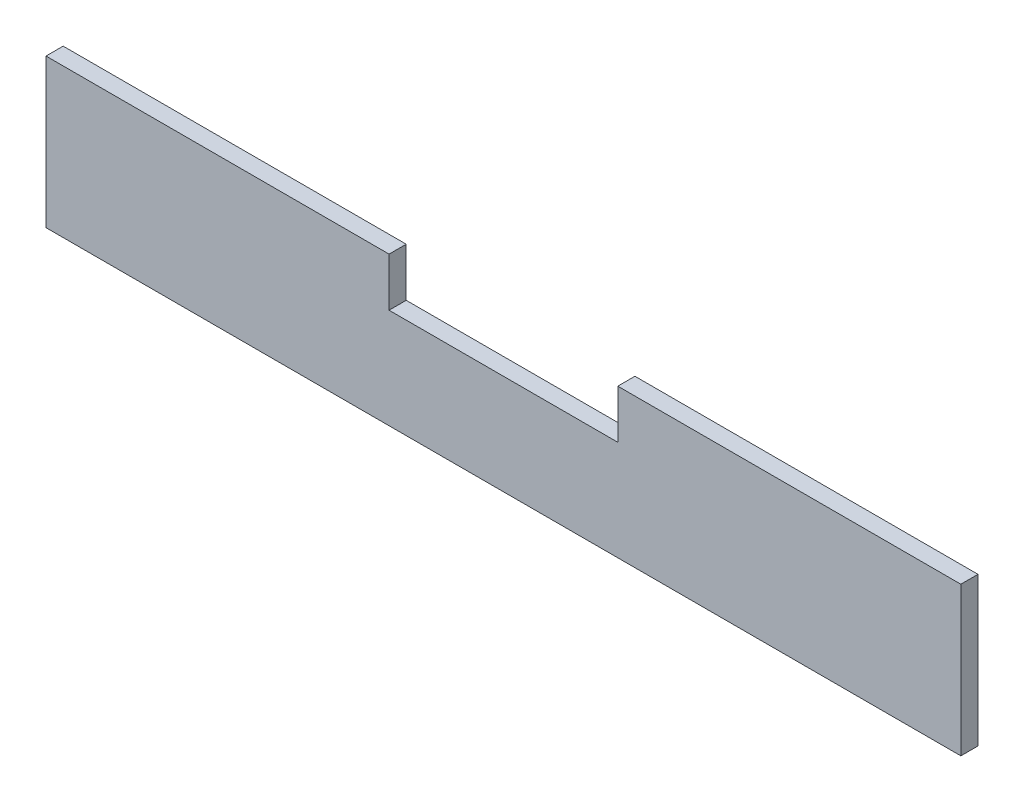
ISO-10303-21;
HEADER;
FILE_DESCRIPTION(('STEP AP214'),'2;1');
FILE_NAME('part.step','',(''),(''),'','','');
FILE_SCHEMA(('AUTOMOTIVE_DESIGN { 1 0 10303 214 1 1 1 1 }'));
ENDSEC;
DATA;
#1=APPLICATION_CONTEXT('core data for automotive mechanical design processes');
#2=APPLICATION_PROTOCOL_DEFINITION('international standard','automotive_design',2000,#1);
#3=PRODUCT_CONTEXT('',#1,'mechanical');
#4=PRODUCT('Part','Part','',(#3));
#5=PRODUCT_RELATED_PRODUCT_CATEGORY('part','',(#4));
#6=PRODUCT_DEFINITION_FORMATION('','',#4);
#7=PRODUCT_DEFINITION_CONTEXT('part definition',#1,'design');
#8=PRODUCT_DEFINITION('design','',#6,#7);
#9=PRODUCT_DEFINITION_SHAPE('','',#8);
#10=(LENGTH_UNIT() NAMED_UNIT(*) SI_UNIT(.MILLI.,.METRE.));
#11=(NAMED_UNIT(*) PLANE_ANGLE_UNIT() SI_UNIT($,.RADIAN.));
#12=(NAMED_UNIT(*) SI_UNIT($,.STERADIAN.) SOLID_ANGLE_UNIT());
#13=UNCERTAINTY_MEASURE_WITH_UNIT(LENGTH_MEASURE(1.E-05),#10,'distance_accuracy_value','');
#14=(GEOMETRIC_REPRESENTATION_CONTEXT(3) GLOBAL_UNCERTAINTY_ASSIGNED_CONTEXT((#13)) GLOBAL_UNIT_ASSIGNED_CONTEXT((#10,
#11,#12)) REPRESENTATION_CONTEXT('',''));
#15=CARTESIAN_POINT('',(0.,0.,0.));
#16=DIRECTION('',(0.,0.,1.));
#17=DIRECTION('',(1.,0.,0.));
#18=AXIS2_PLACEMENT_3D('',#15,#16,#17);
#19=CARTESIAN_POINT('',(0.,76.2,0.));
#20=DIRECTION('',(0.,1.,0.));
#21=DIRECTION('',(0.,0.,1.));
#22=AXIS2_PLACEMENT_3D('',#19,#20,#21);
#23=PLANE('',#22);
#24=DIRECTION('',(0.,0.,-1.));
#25=VECTOR('',#24,1.);
#26=CARTESIAN_POINT('',(127.,76.2,0.));
#27=LINE('',#26,#25);
#28=CARTESIAN_POINT('',(127.,76.2,-1016.));
#29=VERTEX_POINT('',#28);
#30=CARTESIAN_POINT('',(127.,76.2,-1035.05));
#31=VERTEX_POINT('',#30);
#32=EDGE_CURVE('E11',#29,#31,#27,.T.);
#33=ORIENTED_EDGE('',*,*,#32,.F.);
#34=DIRECTION('',(1.,0.,0.));
#35=VECTOR('',#34,1.);
#36=CARTESIAN_POINT('',(0.,76.2,-1016.));
#37=LINE('',#36,#35);
#38=CARTESIAN_POINT('',(508.,76.2,-1016.));
#39=VERTEX_POINT('',#38);
#40=EDGE_CURVE('E168',#29,#39,#37,.T.);
#41=ORIENTED_EDGE('',*,*,#40,.T.);
#42=DIRECTION('',(0.,0.,-1.));
#43=VECTOR('',#42,1.);
#44=CARTESIAN_POINT('',(508.,76.2,0.));
#45=LINE('',#44,#43);
#46=CARTESIAN_POINT('',(508.,76.2,-1035.05));
#47=VERTEX_POINT('',#46);
#48=EDGE_CURVE('E128',#39,#47,#45,.T.);
#49=ORIENTED_EDGE('',*,*,#48,.T.);
#50=DIRECTION('',(1.,0.,0.));
#51=VECTOR('',#50,1.);
#52=CARTESIAN_POINT('',(0.,76.2,-1035.05));
#53=LINE('',#52,#51);
#54=EDGE_CURVE('E117',#31,#47,#53,.T.);
#55=ORIENTED_EDGE('',*,*,#54,.F.);
#56=EDGE_LOOP('',(#33,#41,#49,#55));
#57=FACE_BOUND('',#56,.T.);
#58=ADVANCED_FACE('F42',(#57),#23,.T.);
#59=CARTESIAN_POINT('',(-508.,-88.9,0.));
#60=DIRECTION('',(1.,0.,0.));
#61=DIRECTION('',(0.,0.,-1.));
#62=AXIS2_PLACEMENT_3D('',#59,#60,#61);
#63=PLANE('',#62);
#64=DIRECTION('',(0.,1.,0.));
#65=VECTOR('',#64,1.);
#66=CARTESIAN_POINT('',(-508.,-88.9,-1016.));
#67=LINE('',#66,#65);
#68=CARTESIAN_POINT('',(-508.,-88.9,-1016.));
#69=VERTEX_POINT('',#68);
#70=CARTESIAN_POINT('',(-508.,76.2,-1016.));
#71=VERTEX_POINT('',#70);
#72=EDGE_CURVE('E51',#69,#71,#67,.T.);
#73=ORIENTED_EDGE('',*,*,#72,.T.);
#74=DIRECTION('',(0.,0.,-1.));
#75=VECTOR('',#74,1.);
#76=CARTESIAN_POINT('',(-508.,76.2,0.));
#77=LINE('',#76,#75);
#78=CARTESIAN_POINT('',(-508.,76.2,-1035.05));
#79=VERTEX_POINT('',#78);
#80=EDGE_CURVE('E135',#71,#79,#77,.T.);
#81=ORIENTED_EDGE('',*,*,#80,.T.);
#82=DIRECTION('',(0.,1.,0.));
#83=VECTOR('',#82,1.);
#84=CARTESIAN_POINT('',(-508.,-88.9,-1035.05));
#85=LINE('',#84,#83);
#86=CARTESIAN_POINT('',(-508.,-88.9,-1035.05));
#87=VERTEX_POINT('',#86);
#88=EDGE_CURVE('E159',#87,#79,#85,.T.);
#89=ORIENTED_EDGE('',*,*,#88,.F.);
#90=DIRECTION('',(0.,0.,-1.));
#91=VECTOR('',#90,1.);
#92=CARTESIAN_POINT('',(-508.,-88.9,0.));
#93=LINE('',#92,#91);
#94=EDGE_CURVE('E153',#69,#87,#93,.T.);
#95=ORIENTED_EDGE('',*,*,#94,.F.);
#96=EDGE_LOOP('',(#73,#81,#89,#95));
#97=FACE_BOUND('',#96,.T.);
#98=ADVANCED_FACE('F179',(#97),#63,.F.);
#99=CARTESIAN_POINT('',(0.,-88.9,0.));
#100=DIRECTION('',(0.,1.,0.));
#101=DIRECTION('',(0.,0.,1.));
#102=AXIS2_PLACEMENT_3D('',#99,#100,#101);
#103=PLANE('',#102);
#104=DIRECTION('',(1.,0.,0.));
#105=VECTOR('',#104,1.);
#106=CARTESIAN_POINT('',(0.,-88.9,-1016.));
#107=LINE('',#106,#105);
#108=CARTESIAN_POINT('',(508.,-88.9,-1016.));
#109=VERTEX_POINT('',#108);
#110=EDGE_CURVE('E143',#69,#109,#107,.T.);
#111=ORIENTED_EDGE('',*,*,#110,.F.);
#112=ORIENTED_EDGE('',*,*,#94,.T.);
#113=DIRECTION('',(1.,0.,0.));
#114=VECTOR('',#113,1.);
#115=CARTESIAN_POINT('',(0.,-88.9,-1035.05));
#116=LINE('',#115,#114);
#117=CARTESIAN_POINT('',(508.,-88.9,-1035.05));
#118=VERTEX_POINT('',#117);
#119=EDGE_CURVE('E150',#87,#118,#116,.T.);
#120=ORIENTED_EDGE('',*,*,#119,.T.);
#121=DIRECTION('',(0.,0.,-1.));
#122=VECTOR('',#121,1.);
#123=CARTESIAN_POINT('',(508.,-88.9,0.));
#124=LINE('',#123,#122);
#125=EDGE_CURVE('E146',#109,#118,#124,.T.);
#126=ORIENTED_EDGE('',*,*,#125,.F.);
#127=EDGE_LOOP('',(#111,#112,#120,#126));
#128=FACE_BOUND('',#127,.T.);
#129=ADVANCED_FACE('F177',(#128),#103,.F.);
#130=CARTESIAN_POINT('',(508.,-88.9,0.));
#131=DIRECTION('',(1.,0.,0.));
#132=DIRECTION('',(0.,0.,-1.));
#133=AXIS2_PLACEMENT_3D('',#130,#131,#132);
#134=PLANE('',#133);
#135=DIRECTION('',(0.,1.,0.));
#136=VECTOR('',#135,1.);
#137=CARTESIAN_POINT('',(508.,-88.9,-1035.05));
#138=LINE('',#137,#136);
#139=EDGE_CURVE('E162',#118,#47,#138,.T.);
#140=ORIENTED_EDGE('',*,*,#139,.T.);
#141=ORIENTED_EDGE('',*,*,#48,.F.);
#142=DIRECTION('',(0.,1.,0.));
#143=VECTOR('',#142,1.);
#144=CARTESIAN_POINT('',(508.,-88.9,-1016.));
#145=LINE('',#144,#143);
#146=EDGE_CURVE('E156',#109,#39,#145,.T.);
#147=ORIENTED_EDGE('',*,*,#146,.F.);
#148=ORIENTED_EDGE('',*,*,#125,.T.);
#149=EDGE_LOOP('',(#140,#141,#147,#148));
#150=FACE_BOUND('',#149,.T.);
#151=ADVANCED_FACE('F172',(#150),#134,.T.);
#152=CARTESIAN_POINT('',(0.,22.225,0.));
#153=DIRECTION('',(0.,1.,0.));
#154=DIRECTION('',(0.,0.,1.));
#155=AXIS2_PLACEMENT_3D('',#152,#153,#154);
#156=PLANE('',#155);
#157=DIRECTION('',(0.,0.,1.));
#158=VECTOR('',#157,1.);
#159=CARTESIAN_POINT('',(127.,22.2250000000002,-1035.05));
#160=LINE('',#159,#158);
#161=CARTESIAN_POINT('',(127.,22.2250000000002,-1035.05));
#162=VERTEX_POINT('',#161);
#163=CARTESIAN_POINT('',(127.,22.2250000000002,-1016.));
#164=VERTEX_POINT('',#163);
#165=EDGE_CURVE('E187',#162,#164,#160,.T.);
#166=ORIENTED_EDGE('',*,*,#165,.F.);
#167=DIRECTION('',(1.,0.,0.));
#168=VECTOR('',#167,1.);
#169=CARTESIAN_POINT('',(-127.,22.2250000000002,-1035.05));
#170=LINE('',#169,#168);
#171=CARTESIAN_POINT('',(-127.,22.2250000000002,-1035.05));
#172=VERTEX_POINT('',#171);
#173=EDGE_CURVE('E121',#172,#162,#170,.T.);
#174=ORIENTED_EDGE('',*,*,#173,.F.);
#175=DIRECTION('',(0.,0.,-1.));
#176=VECTOR('',#175,1.);
#177=CARTESIAN_POINT('',(-127.,22.2250000000002,-1035.05));
#178=LINE('',#177,#176);
#179=CARTESIAN_POINT('',(-127.,22.2250000000002,-1016.));
#180=VERTEX_POINT('',#179);
#181=EDGE_CURVE('E198',#180,#172,#178,.T.);
#182=ORIENTED_EDGE('',*,*,#181,.F.);
#183=DIRECTION('',(-1.,0.,0.));
#184=VECTOR('',#183,1.);
#185=CARTESIAN_POINT('',(0.,22.225,-1016.));
#186=LINE('',#185,#184);
#187=EDGE_CURVE('E201',#164,#180,#186,.T.);
#188=ORIENTED_EDGE('',*,*,#187,.F.);
#189=EDGE_LOOP('',(#166,#174,#182,#188));
#190=FACE_BOUND('',#189,.T.);
#191=ADVANCED_FACE('F220',(#190),#156,.T.);
#192=CARTESIAN_POINT('',(0.,-88.9,-1035.05));
#193=DIRECTION('',(0.,0.,1.));
#194=DIRECTION('',(1.,0.,0.));
#195=AXIS2_PLACEMENT_3D('',#192,#193,#194);
#196=PLANE('',#195);
#197=CARTESIAN_POINT('',(-127.,76.2,-1035.05));
#198=VERTEX_POINT('',#197);
#199=EDGE_CURVE('E130',#79,#198,#53,.T.);
#200=ORIENTED_EDGE('',*,*,#199,.T.);
#201=DIRECTION('',(0.,1.,0.));
#202=VECTOR('',#201,1.);
#203=CARTESIAN_POINT('',(-127.,-2063.39960907998,-1035.05));
#204=LINE('',#203,#202);
#205=EDGE_CURVE('E123',#172,#198,#204,.T.);
#206=ORIENTED_EDGE('',*,*,#205,.F.);
#207=ORIENTED_EDGE('',*,*,#173,.T.);
#208=DIRECTION('',(0.,1.,0.));
#209=VECTOR('',#208,1.);
#210=CARTESIAN_POINT('',(127.,-2063.39960907998,-1035.05));
#211=LINE('',#210,#209);
#212=EDGE_CURVE('E108',#162,#31,#211,.T.);
#213=ORIENTED_EDGE('',*,*,#212,.T.);
#214=ORIENTED_EDGE('',*,*,#54,.T.);
#215=ORIENTED_EDGE('',*,*,#139,.F.);
#216=ORIENTED_EDGE('',*,*,#119,.F.);
#217=ORIENTED_EDGE('',*,*,#88,.T.);
#218=EDGE_LOOP('',(#200,#206,#207,#213,#214,#215,#216,#217));
#219=FACE_BOUND('',#218,.T.);
#220=ADVANCED_FACE('F115',(#219),#196,.F.);
#221=CARTESIAN_POINT('',(0.,-88.9,-1016.));
#222=DIRECTION('',(0.,0.,1.));
#223=DIRECTION('',(1.,0.,0.));
#224=AXIS2_PLACEMENT_3D('',#221,#222,#223);
#225=PLANE('',#224);
#226=DIRECTION('',(0.,-1.,0.));
#227=VECTOR('',#226,1.);
#228=CARTESIAN_POINT('',(-127.,-88.9,-1016.));
#229=LINE('',#228,#227);
#230=CARTESIAN_POINT('',(-127.,76.2,-1016.));
#231=VERTEX_POINT('',#230);
#232=EDGE_CURVE('E197',#231,#180,#229,.T.);
#233=ORIENTED_EDGE('',*,*,#232,.F.);
#234=EDGE_CURVE('E136',#71,#231,#37,.T.);
#235=ORIENTED_EDGE('',*,*,#234,.F.);
#236=ORIENTED_EDGE('',*,*,#72,.F.);
#237=ORIENTED_EDGE('',*,*,#110,.T.);
#238=ORIENTED_EDGE('',*,*,#146,.T.);
#239=ORIENTED_EDGE('',*,*,#40,.F.);
#240=DIRECTION('',(0.,1.,0.));
#241=VECTOR('',#240,1.);
#242=CARTESIAN_POINT('',(127.,-88.9,-1016.));
#243=LINE('',#242,#241);
#244=EDGE_CURVE('E57',#164,#29,#243,.T.);
#245=ORIENTED_EDGE('',*,*,#244,.F.);
#246=ORIENTED_EDGE('',*,*,#187,.T.);
#247=EDGE_LOOP('',(#233,#235,#236,#237,#238,#239,#245,#246));
#248=FACE_BOUND('',#247,.T.);
#249=ADVANCED_FACE('F44',(#248),#225,.T.);
#250=CARTESIAN_POINT('',(127.,-2063.39960907998,-1035.05));
#251=DIRECTION('',(1.,0.,0.));
#252=DIRECTION('',(0.,0.,-1.));
#253=AXIS2_PLACEMENT_3D('',#250,#251,#252);
#254=PLANE('',#253);
#255=ORIENTED_EDGE('',*,*,#244,.T.);
#256=ORIENTED_EDGE('',*,*,#32,.T.);
#257=ORIENTED_EDGE('',*,*,#212,.F.);
#258=ORIENTED_EDGE('',*,*,#165,.T.);
#259=EDGE_LOOP('',(#255,#256,#257,#258));
#260=FACE_BOUND('',#259,.T.);
#261=ADVANCED_FACE('F107',(#260),#254,.F.);
#262=CARTESIAN_POINT('',(-127.,-2063.39960907998,-1035.05));
#263=DIRECTION('',(-1.,0.,0.));
#264=DIRECTION('',(0.,0.,1.));
#265=AXIS2_PLACEMENT_3D('',#262,#263,#264);
#266=PLANE('',#265);
#267=ORIENTED_EDGE('',*,*,#232,.T.);
#268=ORIENTED_EDGE('',*,*,#181,.T.);
#269=ORIENTED_EDGE('',*,*,#205,.T.);
#270=DIRECTION('',(0.,0.,1.));
#271=VECTOR('',#270,1.);
#272=CARTESIAN_POINT('',(-127.,76.2,-1035.05));
#273=LINE('',#272,#271);
#274=EDGE_CURVE('E124',#198,#231,#273,.T.);
#275=ORIENTED_EDGE('',*,*,#274,.T.);
#276=EDGE_LOOP('',(#267,#268,#269,#275));
#277=FACE_BOUND('',#276,.T.);
#278=ADVANCED_FACE('F218',(#277),#266,.F.);
#279=ORIENTED_EDGE('',*,*,#274,.F.);
#280=ORIENTED_EDGE('',*,*,#199,.F.);
#281=ORIENTED_EDGE('',*,*,#80,.F.);
#282=ORIENTED_EDGE('',*,*,#234,.T.);
#283=EDGE_LOOP('',(#279,#280,#281,#282));
#284=FACE_BOUND('',#283,.T.);
#285=ADVANCED_FACE('F184',(#284),#23,.T.);
#286=CLOSED_SHELL('',(#58,#98,#129,#151,#191,#220,#249,#261,#278,#285));
#287=MANIFOLD_SOLID_BREP('B2',#286);
#288=ADVANCED_BREP_SHAPE_REPRESENTATION('',(#18,#287),#14);
#289=SHAPE_DEFINITION_REPRESENTATION(#9,#288);
ENDSEC;
END-ISO-10303-21;
